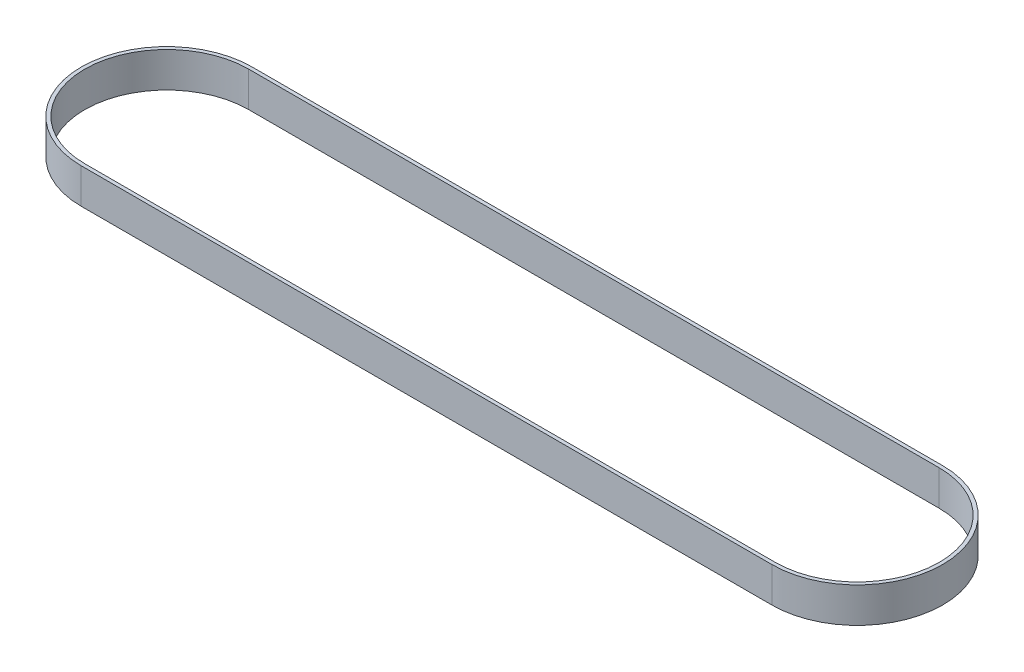
ISO-10303-21;
HEADER;
FILE_DESCRIPTION(('STEP AP214'),'2;1');
FILE_NAME('part.step','',(''),(''),'','','');
FILE_SCHEMA(('AUTOMOTIVE_DESIGN { 1 0 10303 214 1 1 1 1 }'));
ENDSEC;
DATA;
#1=APPLICATION_CONTEXT('core data for automotive mechanical design processes');
#2=APPLICATION_PROTOCOL_DEFINITION('international standard','automotive_design',2000,#1);
#3=PRODUCT_CONTEXT('',#1,'mechanical');
#4=PRODUCT('Part','Part','',(#3));
#5=PRODUCT_RELATED_PRODUCT_CATEGORY('part','',(#4));
#6=PRODUCT_DEFINITION_FORMATION('','',#4);
#7=PRODUCT_DEFINITION_CONTEXT('part definition',#1,'design');
#8=PRODUCT_DEFINITION('design','',#6,#7);
#9=PRODUCT_DEFINITION_SHAPE('','',#8);
#10=(LENGTH_UNIT() NAMED_UNIT(*) SI_UNIT(.MILLI.,.METRE.));
#11=(NAMED_UNIT(*) PLANE_ANGLE_UNIT() SI_UNIT($,.RADIAN.));
#12=(NAMED_UNIT(*) SI_UNIT($,.STERADIAN.) SOLID_ANGLE_UNIT());
#13=UNCERTAINTY_MEASURE_WITH_UNIT(LENGTH_MEASURE(1.E-05),#10,'distance_accuracy_value','');
#14=(GEOMETRIC_REPRESENTATION_CONTEXT(3) GLOBAL_UNCERTAINTY_ASSIGNED_CONTEXT((#13)) GLOBAL_UNIT_ASSIGNED_CONTEXT((#10,
#11,#12)) REPRESENTATION_CONTEXT('',''));
#15=CARTESIAN_POINT('',(0.,0.,0.));
#16=DIRECTION('',(0.,0.,1.));
#17=DIRECTION('',(1.,0.,0.));
#18=AXIS2_PLACEMENT_3D('',#15,#16,#17);
#19=CARTESIAN_POINT('',(0.,15.,-36.5379));
#20=DIRECTION('',(0.,0.,1.));
#21=DIRECTION('',(1.,0.,0.));
#22=AXIS2_PLACEMENT_3D('',#19,#20,#21);
#23=PLANE('',#22);
#24=DIRECTION('',(0.,-1.,0.));
#25=VECTOR('',#24,1.);
#26=CARTESIAN_POINT('',(0.,15.,-36.5379));
#27=LINE('',#26,#25);
#28=CARTESIAN_POINT('',(0.,15.,-36.5379));
#29=VERTEX_POINT('',#28);
#30=CARTESIAN_POINT('',(0.,0.,-36.5379));
#31=VERTEX_POINT('',#30);
#32=EDGE_CURVE('E67',#29,#31,#27,.T.);
#33=ORIENTED_EDGE('',*,*,#32,.F.);
#34=DIRECTION('',(1.,0.,0.));
#35=VECTOR('',#34,1.);
#36=CARTESIAN_POINT('',(0.,15.,-36.5379));
#37=LINE('',#36,#35);
#38=CARTESIAN_POINT('',(295.0718,15.,-36.5379));
#39=VERTEX_POINT('',#38);
#40=EDGE_CURVE('E69',#39,#29,#37,.F.);
#41=ORIENTED_EDGE('',*,*,#40,.F.);
#42=DIRECTION('',(0.,-1.,0.));
#43=VECTOR('',#42,1.);
#44=CARTESIAN_POINT('',(295.0718,15.,-36.5379));
#45=LINE('',#44,#43);
#46=CARTESIAN_POINT('',(295.0718,0.,-36.5379));
#47=VERTEX_POINT('',#46);
#48=EDGE_CURVE('E117',#47,#39,#45,.F.);
#49=ORIENTED_EDGE('',*,*,#48,.F.);
#50=DIRECTION('',(1.,0.,0.));
#51=VECTOR('',#50,1.);
#52=CARTESIAN_POINT('',(0.,0.,-36.5379));
#53=LINE('',#52,#51);
#54=EDGE_CURVE('E71',#47,#31,#53,.F.);
#55=ORIENTED_EDGE('',*,*,#54,.T.);
#56=EDGE_LOOP('',(#33,#41,#49,#55));
#57=FACE_BOUND('',#56,.T.);
#58=ADVANCED_FACE('F18',(#57),#23,.F.);
#59=CARTESIAN_POINT('',(0.,15.,-35.0139));
#60=DIRECTION('',(0.,0.,1.));
#61=DIRECTION('',(1.,0.,0.));
#62=AXIS2_PLACEMENT_3D('',#59,#60,#61);
#63=PLANE('',#62);
#64=DIRECTION('',(1.,0.,0.));
#65=VECTOR('',#64,1.);
#66=CARTESIAN_POINT('',(0.,15.,-35.0139));
#67=LINE('',#66,#65);
#68=CARTESIAN_POINT('',(0.,15.,-35.0139));
#69=VERTEX_POINT('',#68);
#70=CARTESIAN_POINT('',(295.0718,15.,-35.0139));
#71=VERTEX_POINT('',#70);
#72=EDGE_CURVE('E101',#69,#71,#67,.T.);
#73=ORIENTED_EDGE('',*,*,#72,.F.);
#74=DIRECTION('',(0.,-1.,0.));
#75=VECTOR('',#74,1.);
#76=CARTESIAN_POINT('',(0.,15.,-35.0139));
#77=LINE('',#76,#75);
#78=CARTESIAN_POINT('',(0.,0.,-35.0139));
#79=VERTEX_POINT('',#78);
#80=EDGE_CURVE('E76',#69,#79,#77,.T.);
#81=ORIENTED_EDGE('',*,*,#80,.T.);
#82=DIRECTION('',(1.,0.,0.));
#83=VECTOR('',#82,1.);
#84=CARTESIAN_POINT('',(0.,0.,-35.0139));
#85=LINE('',#84,#83);
#86=CARTESIAN_POINT('',(295.0718,0.,-35.0139));
#87=VERTEX_POINT('',#86);
#88=EDGE_CURVE('E122',#79,#87,#85,.T.);
#89=ORIENTED_EDGE('',*,*,#88,.T.);
#90=DIRECTION('',(0.,-1.,0.));
#91=VECTOR('',#90,1.);
#92=CARTESIAN_POINT('',(295.0718,15.,-35.0139));
#93=LINE('',#92,#91);
#94=EDGE_CURVE('E114',#87,#71,#93,.F.);
#95=ORIENTED_EDGE('',*,*,#94,.T.);
#96=EDGE_LOOP('',(#73,#81,#89,#95));
#97=FACE_BOUND('',#96,.T.);
#98=ADVANCED_FACE('F135',(#97),#63,.T.);
#99=CARTESIAN_POINT('',(295.0718,15.,0.));
#100=DIRECTION('',(0.,-1.,0.));
#101=DIRECTION('',(0.,0.,-1.));
#102=AXIS2_PLACEMENT_3D('',#99,#100,#101);
#103=CYLINDRICAL_SURFACE('',#102,35.0139);
#104=DIRECTION('',(0.,1.,0.));
#105=VECTOR('',#104,1.);
#106=CARTESIAN_POINT('',(295.0718,15.,35.0139));
#107=LINE('',#106,#105);
#108=CARTESIAN_POINT('',(295.0718,15.,35.0139));
#109=VERTEX_POINT('',#108);
#110=CARTESIAN_POINT('',(295.0718,0.,35.0139));
#111=VERTEX_POINT('',#110);
#112=EDGE_CURVE('E111',#109,#111,#107,.F.);
#113=ORIENTED_EDGE('',*,*,#112,.F.);
#114=CARTESIAN_POINT('',(295.0718,15.,0.));
#115=DIRECTION('',(0.,-1.,0.));
#116=DIRECTION('',(0.,0.,-1.));
#117=AXIS2_PLACEMENT_3D('',#114,#115,#116);
#118=CIRCLE('',#117,35.0139);
#119=EDGE_CURVE('E103',#71,#109,#118,.T.);
#120=ORIENTED_EDGE('',*,*,#119,.F.);
#121=ORIENTED_EDGE('',*,*,#94,.F.);
#122=CARTESIAN_POINT('',(295.0718,0.,0.));
#123=DIRECTION('',(0.,-1.,0.));
#124=DIRECTION('',(0.,0.,-1.));
#125=AXIS2_PLACEMENT_3D('',#122,#123,#124);
#126=CIRCLE('',#125,35.0139);
#127=EDGE_CURVE('E119',#87,#111,#126,.T.);
#128=ORIENTED_EDGE('',*,*,#127,.T.);
#129=EDGE_LOOP('',(#113,#120,#121,#128));
#130=FACE_BOUND('',#129,.T.);
#131=ADVANCED_FACE('F144',(#130),#103,.F.);
#132=CARTESIAN_POINT('',(0.,15.,35.0139));
#133=DIRECTION('',(0.,0.,-1.));
#134=DIRECTION('',(-1.,0.,0.));
#135=AXIS2_PLACEMENT_3D('',#132,#133,#134);
#136=PLANE('',#135);
#137=DIRECTION('',(1.,0.,0.));
#138=VECTOR('',#137,1.);
#139=CARTESIAN_POINT('',(0.,15.,35.0139));
#140=LINE('',#139,#138);
#141=CARTESIAN_POINT('',(0.,15.,35.0139));
#142=VERTEX_POINT('',#141);
#143=EDGE_CURVE('E84',#109,#142,#140,.F.);
#144=ORIENTED_EDGE('',*,*,#143,.F.);
#145=ORIENTED_EDGE('',*,*,#112,.T.);
#146=DIRECTION('',(1.,0.,0.));
#147=VECTOR('',#146,1.);
#148=CARTESIAN_POINT('',(0.,0.,35.0139));
#149=LINE('',#148,#147);
#150=CARTESIAN_POINT('',(0.,0.,35.0139));
#151=VERTEX_POINT('',#150);
#152=EDGE_CURVE('E97',#111,#151,#149,.F.);
#153=ORIENTED_EDGE('',*,*,#152,.T.);
#154=DIRECTION('',(0.,-1.,0.));
#155=VECTOR('',#154,1.);
#156=CARTESIAN_POINT('',(0.,15.,35.0139));
#157=LINE('',#156,#155);
#158=EDGE_CURVE('E108',#151,#142,#157,.F.);
#159=ORIENTED_EDGE('',*,*,#158,.T.);
#160=EDGE_LOOP('',(#144,#145,#153,#159));
#161=FACE_BOUND('',#160,.T.);
#162=ADVANCED_FACE('F146',(#161),#136,.T.);
#163=CARTESIAN_POINT('',(0.,15.,0.));
#164=DIRECTION('',(0.,-1.,0.));
#165=DIRECTION('',(0.,0.,-1.));
#166=AXIS2_PLACEMENT_3D('',#163,#164,#165);
#167=CYLINDRICAL_SURFACE('',#166,35.0139);
#168=ORIENTED_EDGE('',*,*,#80,.F.);
#169=CARTESIAN_POINT('',(0.,15.,0.));
#170=DIRECTION('',(0.,-1.,0.));
#171=DIRECTION('',(0.,0.,-1.));
#172=AXIS2_PLACEMENT_3D('',#169,#170,#171);
#173=CIRCLE('',#172,35.0139);
#174=EDGE_CURVE('E104',#142,#69,#173,.T.);
#175=ORIENTED_EDGE('',*,*,#174,.F.);
#176=ORIENTED_EDGE('',*,*,#158,.F.);
#177=CARTESIAN_POINT('',(0.,0.,0.));
#178=DIRECTION('',(0.,-1.,0.));
#179=DIRECTION('',(0.,0.,-1.));
#180=AXIS2_PLACEMENT_3D('',#177,#178,#179);
#181=CIRCLE('',#180,35.0139);
#182=EDGE_CURVE('E93',#151,#79,#181,.T.);
#183=ORIENTED_EDGE('',*,*,#182,.T.);
#184=EDGE_LOOP('',(#168,#175,#176,#183));
#185=FACE_BOUND('',#184,.T.);
#186=ADVANCED_FACE('F152',(#185),#167,.F.);
#187=CARTESIAN_POINT('',(0.,15.,0.));
#188=DIRECTION('',(0.,-1.,0.));
#189=DIRECTION('',(0.,0.,-1.));
#190=AXIS2_PLACEMENT_3D('',#187,#188,#189);
#191=CYLINDRICAL_SURFACE('',#190,36.5379);
#192=CARTESIAN_POINT('',(0.,15.,0.));
#193=DIRECTION('',(0.,-1.,0.));
#194=DIRECTION('',(0.,0.,-1.));
#195=AXIS2_PLACEMENT_3D('',#192,#193,#194);
#196=CIRCLE('',#195,36.5379);
#197=CARTESIAN_POINT('',(0.,15.,36.5379));
#198=VERTEX_POINT('',#197);
#199=EDGE_CURVE('E21',#29,#198,#196,.F.);
#200=ORIENTED_EDGE('',*,*,#199,.F.);
#201=ORIENTED_EDGE('',*,*,#32,.T.);
#202=CARTESIAN_POINT('',(0.,0.,0.));
#203=DIRECTION('',(0.,-1.,0.));
#204=DIRECTION('',(0.,0.,-1.));
#205=AXIS2_PLACEMENT_3D('',#202,#203,#204);
#206=CIRCLE('',#205,36.5379);
#207=CARTESIAN_POINT('',(0.,0.,36.5379));
#208=VERTEX_POINT('',#207);
#209=EDGE_CURVE('E90',#31,#208,#206,.F.);
#210=ORIENTED_EDGE('',*,*,#209,.T.);
#211=DIRECTION('',(0.,1.,0.));
#212=VECTOR('',#211,1.);
#213=CARTESIAN_POINT('',(0.,15.,36.5379));
#214=LINE('',#213,#212);
#215=EDGE_CURVE('E89',#208,#198,#214,.T.);
#216=ORIENTED_EDGE('',*,*,#215,.T.);
#217=EDGE_LOOP('',(#200,#201,#210,#216));
#218=FACE_BOUND('',#217,.T.);
#219=ADVANCED_FACE('F87',(#218),#191,.T.);
#220=CARTESIAN_POINT('',(0.,15.,0.));
#221=DIRECTION('',(0.,1.,0.));
#222=DIRECTION('',(0.,0.,1.));
#223=AXIS2_PLACEMENT_3D('',#220,#221,#222);
#224=PLANE('',#223);
#225=ORIENTED_EDGE('',*,*,#72,.T.);
#226=ORIENTED_EDGE('',*,*,#119,.T.);
#227=ORIENTED_EDGE('',*,*,#143,.T.);
#228=ORIENTED_EDGE('',*,*,#174,.T.);
#229=EDGE_LOOP('',(#225,#226,#227,#228));
#230=FACE_BOUND('',#229,.T.);
#231=CARTESIAN_POINT('',(295.0718,15.,0.));
#232=DIRECTION('',(0.,-1.,0.));
#233=DIRECTION('',(0.,0.,-1.));
#234=AXIS2_PLACEMENT_3D('',#231,#232,#233);
#235=CIRCLE('',#234,36.5379);
#236=CARTESIAN_POINT('',(295.0718,15.,36.5379));
#237=VERTEX_POINT('',#236);
#238=EDGE_CURVE('E83',#39,#237,#235,.T.);
#239=ORIENTED_EDGE('',*,*,#238,.F.);
#240=ORIENTED_EDGE('',*,*,#40,.T.);
#241=ORIENTED_EDGE('',*,*,#199,.T.);
#242=DIRECTION('',(-1.,0.,0.));
#243=VECTOR('',#242,1.);
#244=CARTESIAN_POINT('',(0.,15.,36.5379));
#245=LINE('',#244,#243);
#246=EDGE_CURVE('E92',#198,#237,#245,.F.);
#247=ORIENTED_EDGE('',*,*,#246,.T.);
#248=EDGE_LOOP('',(#239,#240,#241,#247));
#249=FACE_BOUND('',#248,.T.);
#250=ADVANCED_FACE('F80',(#230,#249),#224,.T.);
#251=CARTESIAN_POINT('',(295.0718,15.,0.));
#252=DIRECTION('',(0.,-1.,0.));
#253=DIRECTION('',(0.,0.,-1.));
#254=AXIS2_PLACEMENT_3D('',#251,#252,#253);
#255=CYLINDRICAL_SURFACE('',#254,36.5379);
#256=ORIENTED_EDGE('',*,*,#238,.T.);
#257=DIRECTION('',(0.,1.,0.));
#258=VECTOR('',#257,1.);
#259=CARTESIAN_POINT('',(295.0718,15.,36.5379));
#260=LINE('',#259,#258);
#261=CARTESIAN_POINT('',(295.0718,0.,36.5379));
#262=VERTEX_POINT('',#261);
#263=EDGE_CURVE('E27',#237,#262,#260,.F.);
#264=ORIENTED_EDGE('',*,*,#263,.T.);
#265=CARTESIAN_POINT('',(295.0718,0.,0.));
#266=DIRECTION('',(0.,-1.,0.));
#267=DIRECTION('',(0.,0.,-1.));
#268=AXIS2_PLACEMENT_3D('',#265,#266,#267);
#269=CIRCLE('',#268,36.5379);
#270=EDGE_CURVE('E35',#262,#47,#269,.F.);
#271=ORIENTED_EDGE('',*,*,#270,.T.);
#272=ORIENTED_EDGE('',*,*,#48,.T.);
#273=EDGE_LOOP('',(#256,#264,#271,#272));
#274=FACE_BOUND('',#273,.T.);
#275=ADVANCED_FACE('F163',(#274),#255,.T.);
#276=CARTESIAN_POINT('',(0.,0.,0.));
#277=DIRECTION('',(0.,1.,0.));
#278=DIRECTION('',(0.,0.,1.));
#279=AXIS2_PLACEMENT_3D('',#276,#277,#278);
#280=PLANE('',#279);
#281=ORIENTED_EDGE('',*,*,#152,.F.);
#282=ORIENTED_EDGE('',*,*,#127,.F.);
#283=ORIENTED_EDGE('',*,*,#88,.F.);
#284=ORIENTED_EDGE('',*,*,#182,.F.);
#285=EDGE_LOOP('',(#281,#282,#283,#284));
#286=FACE_BOUND('',#285,.T.);
#287=ORIENTED_EDGE('',*,*,#54,.F.);
#288=ORIENTED_EDGE('',*,*,#270,.F.);
#289=DIRECTION('',(-1.,0.,0.));
#290=VECTOR('',#289,1.);
#291=CARTESIAN_POINT('',(0.,0.,36.5379));
#292=LINE('',#291,#290);
#293=EDGE_CURVE('E11',#262,#208,#292,.T.);
#294=ORIENTED_EDGE('',*,*,#293,.T.);
#295=ORIENTED_EDGE('',*,*,#209,.F.);
#296=EDGE_LOOP('',(#287,#288,#294,#295));
#297=FACE_BOUND('',#296,.T.);
#298=ADVANCED_FACE('F155',(#286,#297),#280,.F.);
#299=CARTESIAN_POINT('',(0.,15.,36.5379));
#300=DIRECTION('',(0.,0.,-1.));
#301=DIRECTION('',(-1.,0.,0.));
#302=AXIS2_PLACEMENT_3D('',#299,#300,#301);
#303=PLANE('',#302);
#304=ORIENTED_EDGE('',*,*,#263,.F.);
#305=ORIENTED_EDGE('',*,*,#246,.F.);
#306=ORIENTED_EDGE('',*,*,#215,.F.);
#307=ORIENTED_EDGE('',*,*,#293,.F.);
#308=EDGE_LOOP('',(#304,#305,#306,#307));
#309=FACE_BOUND('',#308,.T.);
#310=ADVANCED_FACE('F164',(#309),#303,.F.);
#311=CLOSED_SHELL('',(#58,#98,#131,#162,#186,#219,#250,#275,#298,#310));
#312=MANIFOLD_SOLID_BREP('B1',#311);
#313=ADVANCED_BREP_SHAPE_REPRESENTATION('',(#18,#312),#14);
#314=SHAPE_DEFINITION_REPRESENTATION(#9,#313);
ENDSEC;
END-ISO-10303-21;
